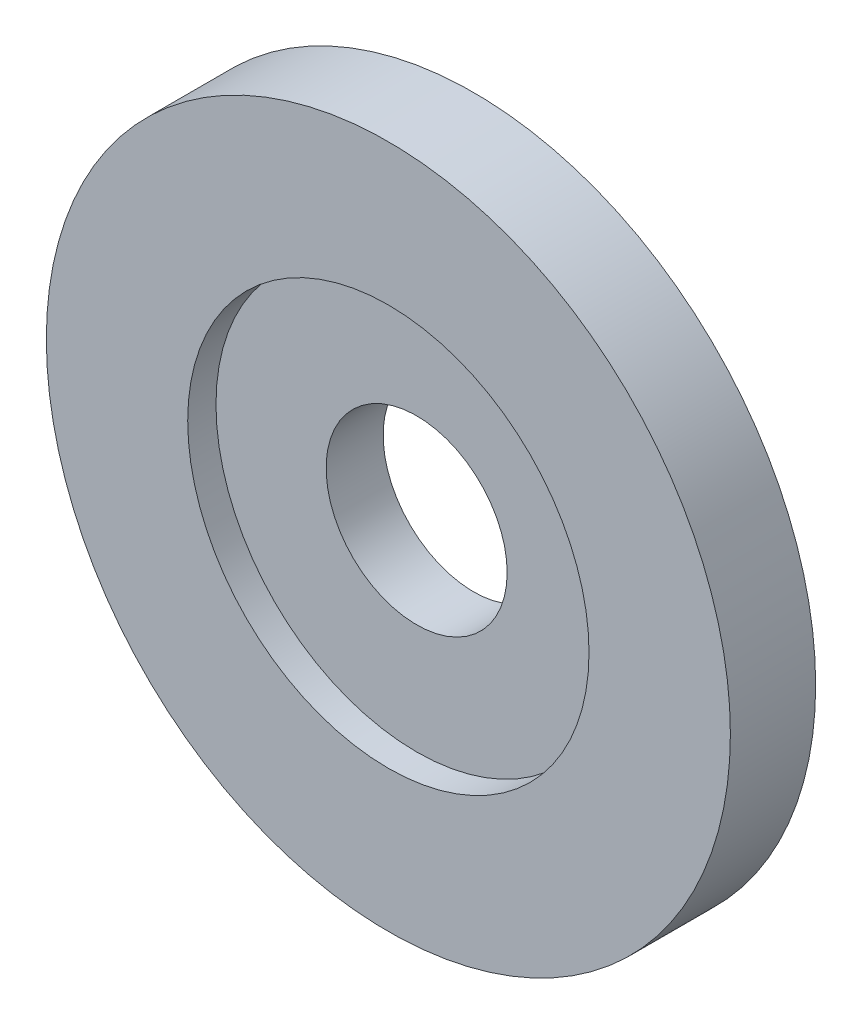
ISO-10303-21;
HEADER;
FILE_DESCRIPTION(('STEP AP214'),'2;1');
FILE_NAME('part.step','',(''),(''),'','','');
FILE_SCHEMA(('AUTOMOTIVE_DESIGN { 1 0 10303 214 1 1 1 1 }'));
ENDSEC;
DATA;
#1=APPLICATION_CONTEXT('core data for automotive mechanical design processes');
#2=APPLICATION_PROTOCOL_DEFINITION('international standard','automotive_design',2000,#1);
#3=PRODUCT_CONTEXT('',#1,'mechanical');
#4=PRODUCT('Part','Part','',(#3));
#5=PRODUCT_RELATED_PRODUCT_CATEGORY('part','',(#4));
#6=PRODUCT_DEFINITION_FORMATION('','',#4);
#7=PRODUCT_DEFINITION_CONTEXT('part definition',#1,'design');
#8=PRODUCT_DEFINITION('design','',#6,#7);
#9=PRODUCT_DEFINITION_SHAPE('','',#8);
#10=(LENGTH_UNIT() NAMED_UNIT(*) SI_UNIT(.MILLI.,.METRE.));
#11=(NAMED_UNIT(*) PLANE_ANGLE_UNIT() SI_UNIT($,.RADIAN.));
#12=(NAMED_UNIT(*) SI_UNIT($,.STERADIAN.) SOLID_ANGLE_UNIT());
#13=UNCERTAINTY_MEASURE_WITH_UNIT(LENGTH_MEASURE(1.E-05),#10,'distance_accuracy_value','');
#14=(GEOMETRIC_REPRESENTATION_CONTEXT(3) GLOBAL_UNCERTAINTY_ASSIGNED_CONTEXT((#13)) GLOBAL_UNIT_ASSIGNED_CONTEXT((#10,
#11,#12)) REPRESENTATION_CONTEXT('',''));
#15=CARTESIAN_POINT('',(0.,0.,0.));
#16=DIRECTION('',(0.,0.,1.));
#17=DIRECTION('',(1.,0.,0.));
#18=AXIS2_PLACEMENT_3D('',#15,#16,#17);
#19=CARTESIAN_POINT('',(-35.2684049381343,-193.37199559759,3.175));
#20=DIRECTION('',(0.,0.,1.));
#21=DIRECTION('',(1.,0.,0.));
#22=AXIS2_PLACEMENT_3D('',#19,#20,#21);
#23=PLANE('',#22);
#24=CARTESIAN_POINT('',(-35.2684049381343,-193.37199559759,3.175));
#25=DIRECTION('',(0.,0.,1.));
#26=DIRECTION('',(1.,0.,0.));
#27=AXIS2_PLACEMENT_3D('',#24,#25,#26);
#28=CIRCLE('',#27,5.04189999999998);
#29=CARTESIAN_POINT('',(-30.2265049381343,-193.37199559759,3.175));
#30=VERTEX_POINT('',#29);
#31=EDGE_CURVE('E41',#30,#30,#28,.T.);
#32=ORIENTED_EDGE('',*,*,#31,.F.);
#33=EDGE_LOOP('',(#32));
#34=FACE_BOUND('',#33,.T.);
#35=CARTESIAN_POINT('',(-35.2684049381343,-193.37199559759,3.175));
#36=DIRECTION('',(0.,0.,1.));
#37=DIRECTION('',(1.,0.,0.));
#38=AXIS2_PLACEMENT_3D('',#35,#36,#37);
#39=CIRCLE('',#38,11.176);
#40=CARTESIAN_POINT('',(-24.0924049381343,-193.37199559759,3.175));
#41=VERTEX_POINT('',#40);
#42=EDGE_CURVE('E10',#41,#41,#39,.F.);
#43=ORIENTED_EDGE('',*,*,#42,.F.);
#44=EDGE_LOOP('',(#43));
#45=FACE_BOUND('',#44,.T.);
#46=ADVANCED_FACE('F30',(#34,#45),#23,.T.);
#47=CARTESIAN_POINT('',(-35.2684049381343,-193.37199559759,0.));
#48=DIRECTION('',(0.,0.,1.));
#49=DIRECTION('',(1.,0.,0.));
#50=AXIS2_PLACEMENT_3D('',#47,#48,#49);
#51=PLANE('',#50);
#52=CARTESIAN_POINT('',(-35.2684049381343,-193.37199559759,0.));
#53=DIRECTION('',(0.,0.,1.));
#54=DIRECTION('',(1.,0.,0.));
#55=AXIS2_PLACEMENT_3D('',#52,#53,#54);
#56=CIRCLE('',#55,19.05);
#57=CARTESIAN_POINT('',(-16.2184049381342,-193.37199559759,0.));
#58=VERTEX_POINT('',#57);
#59=EDGE_CURVE('E37',#58,#58,#56,.T.);
#60=ORIENTED_EDGE('',*,*,#59,.F.);
#61=EDGE_LOOP('',(#60));
#62=FACE_BOUND('',#61,.T.);
#63=CARTESIAN_POINT('',(-35.2684049381343,-193.37199559759,0.));
#64=DIRECTION('',(0.,0.,1.));
#65=DIRECTION('',(1.,0.,0.));
#66=AXIS2_PLACEMENT_3D('',#63,#64,#65);
#67=CIRCLE('',#66,5.04189999999998);
#68=CARTESIAN_POINT('',(-30.2265049381343,-193.37199559759,0.));
#69=VERTEX_POINT('',#68);
#70=EDGE_CURVE('E45',#69,#69,#67,.T.);
#71=ORIENTED_EDGE('',*,*,#70,.T.);
#72=EDGE_LOOP('',(#71));
#73=FACE_BOUND('',#72,.T.);
#74=ADVANCED_FACE('F72',(#62,#73),#51,.F.);
#75=CARTESIAN_POINT('',(-35.2684049381343,-193.37199559759,3.175));
#76=DIRECTION('',(0.,0.,-1.));
#77=DIRECTION('',(-1.,0.,0.));
#78=AXIS2_PLACEMENT_3D('',#75,#76,#77);
#79=CYLINDRICAL_SURFACE('',#78,19.05);
#80=ORIENTED_EDGE('',*,*,#59,.T.);
#81=EDGE_LOOP('',(#80));
#82=FACE_BOUND('',#81,.T.);
#83=CARTESIAN_POINT('',(-35.2684049381343,-193.37199559759,4.7498));
#84=DIRECTION('',(0.,0.,1.));
#85=DIRECTION('',(1.,0.,0.));
#86=AXIS2_PLACEMENT_3D('',#83,#84,#85);
#87=CIRCLE('',#86,19.05);
#88=CARTESIAN_POINT('',(-16.2184049381342,-193.37199559759,4.7498));
#89=VERTEX_POINT('',#88);
#90=EDGE_CURVE('E49',#89,#89,#87,.T.);
#91=ORIENTED_EDGE('',*,*,#90,.F.);
#92=EDGE_LOOP('',(#91));
#93=FACE_BOUND('',#92,.T.);
#94=ADVANCED_FACE('F32',(#82,#93),#79,.T.);
#95=CARTESIAN_POINT('',(-35.2684049381343,-193.37199559759,3.175));
#96=DIRECTION('',(0.,0.,-1.));
#97=DIRECTION('',(-1.,0.,0.));
#98=AXIS2_PLACEMENT_3D('',#95,#96,#97);
#99=CYLINDRICAL_SURFACE('',#98,5.04189999999998);
#100=ORIENTED_EDGE('',*,*,#31,.T.);
#101=EDGE_LOOP('',(#100));
#102=FACE_BOUND('',#101,.T.);
#103=ORIENTED_EDGE('',*,*,#70,.F.);
#104=EDGE_LOOP('',(#103));
#105=FACE_BOUND('',#104,.T.);
#106=ADVANCED_FACE('F61',(#102,#105),#99,.F.);
#107=CARTESIAN_POINT('',(-35.2684049381343,-193.37199559759,4.7498));
#108=DIRECTION('',(0.,0.,1.));
#109=DIRECTION('',(1.,0.,0.));
#110=AXIS2_PLACEMENT_3D('',#107,#108,#109);
#111=PLANE('',#110);
#112=ORIENTED_EDGE('',*,*,#90,.T.);
#113=EDGE_LOOP('',(#112));
#114=FACE_BOUND('',#113,.T.);
#115=CARTESIAN_POINT('',(-35.2684049381343,-193.37199559759,4.7498));
#116=DIRECTION('',(0.,0.,1.));
#117=DIRECTION('',(1.,0.,0.));
#118=AXIS2_PLACEMENT_3D('',#115,#116,#117);
#119=CIRCLE('',#118,11.176);
#120=CARTESIAN_POINT('',(-24.0924049381343,-193.37199559759,4.7498));
#121=VERTEX_POINT('',#120);
#122=EDGE_CURVE('E53',#121,#121,#119,.T.);
#123=ORIENTED_EDGE('',*,*,#122,.F.);
#124=EDGE_LOOP('',(#123));
#125=FACE_BOUND('',#124,.T.);
#126=ADVANCED_FACE('F59',(#114,#125),#111,.T.);
#127=CARTESIAN_POINT('',(-35.2684049381343,-193.37199559759,4.7498));
#128=DIRECTION('',(0.,0.,-1.));
#129=DIRECTION('',(-1.,0.,0.));
#130=AXIS2_PLACEMENT_3D('',#127,#128,#129);
#131=CYLINDRICAL_SURFACE('',#130,11.176);
#132=ORIENTED_EDGE('',*,*,#122,.T.);
#133=EDGE_LOOP('',(#132));
#134=FACE_BOUND('',#133,.T.);
#135=ORIENTED_EDGE('',*,*,#42,.T.);
#136=EDGE_LOOP('',(#135));
#137=FACE_BOUND('',#136,.T.);
#138=ADVANCED_FACE('F57',(#134,#137),#131,.F.);
#139=CLOSED_SHELL('',(#46,#74,#94,#106,#126,#138));
#140=MANIFOLD_SOLID_BREP('B2',#139);
#141=ADVANCED_BREP_SHAPE_REPRESENTATION('',(#18,#140),#14);
#142=SHAPE_DEFINITION_REPRESENTATION(#9,#141);
ENDSEC;
END-ISO-10303-21;
